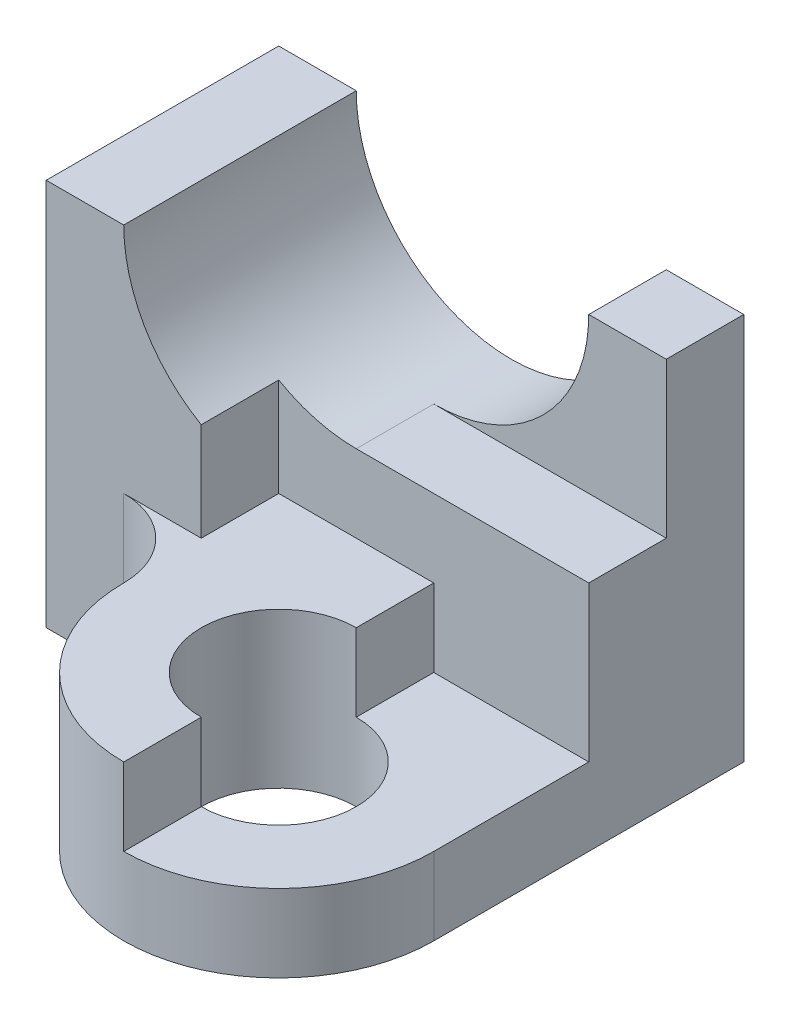
ISO-10303-21;
HEADER;
FILE_DESCRIPTION(('STEP AP214'),'2;1');
FILE_NAME('part.step','',(''),(''),'','','');
FILE_SCHEMA(('AUTOMOTIVE_DESIGN { 1 0 10303 214 1 1 1 1 }'));
ENDSEC;
DATA;
#1=APPLICATION_CONTEXT('core data for automotive mechanical design processes');
#2=APPLICATION_PROTOCOL_DEFINITION('international standard','automotive_design',2000,#1);
#3=PRODUCT_CONTEXT('',#1,'mechanical');
#4=PRODUCT('Part','Part','',(#3));
#5=PRODUCT_RELATED_PRODUCT_CATEGORY('part','',(#4));
#6=PRODUCT_DEFINITION_FORMATION('','',#4);
#7=PRODUCT_DEFINITION_CONTEXT('part definition',#1,'design');
#8=PRODUCT_DEFINITION('design','',#6,#7);
#9=PRODUCT_DEFINITION_SHAPE('','',#8);
#10=(LENGTH_UNIT() NAMED_UNIT(*) SI_UNIT(.MILLI.,.METRE.));
#11=(NAMED_UNIT(*) PLANE_ANGLE_UNIT() SI_UNIT($,.RADIAN.));
#12=(NAMED_UNIT(*) SI_UNIT($,.STERADIAN.) SOLID_ANGLE_UNIT());
#13=UNCERTAINTY_MEASURE_WITH_UNIT(LENGTH_MEASURE(1.E-05),#10,'distance_accuracy_value','');
#14=(GEOMETRIC_REPRESENTATION_CONTEXT(3) GLOBAL_UNCERTAINTY_ASSIGNED_CONTEXT((#13)) GLOBAL_UNIT_ASSIGNED_CONTEXT((#10,
#11,#12)) REPRESENTATION_CONTEXT('',''));
#15=CARTESIAN_POINT('',(0.,0.,0.));
#16=DIRECTION('',(0.,0.,1.));
#17=DIRECTION('',(1.,0.,0.));
#18=AXIS2_PLACEMENT_3D('',#15,#16,#17);
#19=CARTESIAN_POINT('',(0.,0.,3.));
#20=DIRECTION('',(0.,0.,1.));
#21=DIRECTION('',(1.,0.,0.));
#22=AXIS2_PLACEMENT_3D('',#19,#20,#21);
#23=PLANE('',#22);
#24=DIRECTION('',(1.,0.,0.));
#25=VECTOR('',#24,1.);
#26=CARTESIAN_POINT('',(-3.,-5.,3.));
#27=LINE('',#26,#25);
#28=CARTESIAN_POINT('',(-3.,-5.,3.));
#29=VERTEX_POINT('',#28);
#30=CARTESIAN_POINT('',(-2.,-5.,3.));
#31=VERTEX_POINT('',#30);
#32=EDGE_CURVE('E243',#29,#31,#27,.T.);
#33=ORIENTED_EDGE('',*,*,#32,.T.);
#34=DIRECTION('',(0.,-1.,0.));
#35=VECTOR('',#34,1.);
#36=CARTESIAN_POINT('',(-2.,-3.,3.));
#37=LINE('',#36,#35);
#38=CARTESIAN_POINT('',(-2.,-3.,3.));
#39=VERTEX_POINT('',#38);
#40=EDGE_CURVE('E56',#39,#31,#37,.T.);
#41=ORIENTED_EDGE('',*,*,#40,.F.);
#42=DIRECTION('',(1.,0.,0.));
#43=VECTOR('',#42,1.);
#44=CARTESIAN_POINT('',(-2.,-3.,3.));
#45=LINE('',#44,#43);
#46=CARTESIAN_POINT('',(-1.,-3.,3.));
#47=VERTEX_POINT('',#46);
#48=EDGE_CURVE('E195',#39,#47,#45,.T.);
#49=ORIENTED_EDGE('',*,*,#48,.T.);
#50=DIRECTION('',(0.,-1.,0.));
#51=VECTOR('',#50,1.);
#52=CARTESIAN_POINT('',(-1.,-1.73205080756888,3.));
#53=LINE('',#52,#51);
#54=CARTESIAN_POINT('',(-1.,-1.73205080756888,3.));
#55=VERTEX_POINT('',#54);
#56=EDGE_CURVE('E212',#55,#47,#53,.T.);
#57=ORIENTED_EDGE('',*,*,#56,.F.);
#58=CARTESIAN_POINT('',(0.,0.,3.));
#59=DIRECTION('',(0.,0.,-1.));
#60=DIRECTION('',(1.,0.,0.));
#61=AXIS2_PLACEMENT_3D('',#58,#59,#60);
#62=CIRCLE('',#61,2.);
#63=CARTESIAN_POINT('',(-2.,0.,3.));
#64=VERTEX_POINT('',#63);
#65=EDGE_CURVE('E236',#55,#64,#62,.T.);
#66=ORIENTED_EDGE('',*,*,#65,.T.);
#67=DIRECTION('',(-1.,0.,0.));
#68=VECTOR('',#67,1.);
#69=CARTESIAN_POINT('',(-2.,0.,3.));
#70=LINE('',#69,#68);
#71=CARTESIAN_POINT('',(-3.,0.,3.));
#72=VERTEX_POINT('',#71);
#73=EDGE_CURVE('E238',#64,#72,#70,.T.);
#74=ORIENTED_EDGE('',*,*,#73,.T.);
#75=DIRECTION('',(0.,-1.,0.));
#76=VECTOR('',#75,1.);
#77=CARTESIAN_POINT('',(-3.,0.,3.));
#78=LINE('',#77,#76);
#79=EDGE_CURVE('E241',#72,#29,#78,.T.);
#80=ORIENTED_EDGE('',*,*,#79,.T.);
#81=EDGE_LOOP('',(#33,#41,#49,#57,#66,#74,#80));
#82=FACE_BOUND('',#81,.T.);
#83=ADVANCED_FACE('F33',(#82),#23,.T.);
#84=CARTESIAN_POINT('',(-1.,-5.,2.));
#85=DIRECTION('',(0.,0.,-1.));
#86=DIRECTION('',(-1.,0.,0.));
#87=AXIS2_PLACEMENT_3D('',#84,#85,#86);
#88=PLANE('',#87);
#89=DIRECTION('',(1.,0.,0.));
#90=VECTOR('',#89,1.);
#91=CARTESIAN_POINT('',(-1.,-3.,2.));
#92=LINE('',#91,#90);
#93=CARTESIAN_POINT('',(-1.,-3.,2.));
#94=VERTEX_POINT('',#93);
#95=CARTESIAN_POINT('',(1.,-3.,2.));
#96=VERTEX_POINT('',#95);
#97=EDGE_CURVE('E159',#94,#96,#92,.T.);
#98=ORIENTED_EDGE('',*,*,#97,.T.);
#99=DIRECTION('',(0.,1.,0.));
#100=VECTOR('',#99,1.);
#101=CARTESIAN_POINT('',(1.,-4.,2.));
#102=LINE('',#101,#100);
#103=CARTESIAN_POINT('',(1.,-4.,2.));
#104=VERTEX_POINT('',#103);
#105=EDGE_CURVE('E153',#104,#96,#102,.T.);
#106=ORIENTED_EDGE('',*,*,#105,.F.);
#107=DIRECTION('',(-1.,0.,0.));
#108=VECTOR('',#107,1.);
#109=CARTESIAN_POINT('',(1.,-4.,2.));
#110=LINE('',#109,#108);
#111=CARTESIAN_POINT('',(3.,-4.,2.));
#112=VERTEX_POINT('',#111);
#113=EDGE_CURVE('E155',#112,#104,#110,.T.);
#114=ORIENTED_EDGE('',*,*,#113,.F.);
#115=DIRECTION('',(0.,1.,0.));
#116=VECTOR('',#115,1.);
#117=CARTESIAN_POINT('',(3.,-5.,2.));
#118=LINE('',#117,#116);
#119=CARTESIAN_POINT('',(3.,-2.,2.));
#120=VERTEX_POINT('',#119);
#121=EDGE_CURVE('E211',#112,#120,#118,.T.);
#122=ORIENTED_EDGE('',*,*,#121,.T.);
#123=DIRECTION('',(-1.,0.,0.));
#124=VECTOR('',#123,1.);
#125=CARTESIAN_POINT('',(0.,-2.,2.));
#126=LINE('',#125,#124);
#127=CARTESIAN_POINT('',(0.,-2.,2.));
#128=VERTEX_POINT('',#127);
#129=EDGE_CURVE('E274',#120,#128,#126,.T.);
#130=ORIENTED_EDGE('',*,*,#129,.T.);
#131=CARTESIAN_POINT('',(0.,0.,2.));
#132=DIRECTION('',(0.,0.,-1.));
#133=DIRECTION('',(-1.,0.,0.));
#134=AXIS2_PLACEMENT_3D('',#131,#132,#133);
#135=CIRCLE('',#134,2.);
#136=CARTESIAN_POINT('',(-1.,-1.73205080756888,2.));
#137=VERTEX_POINT('',#136);
#138=EDGE_CURVE('E219',#137,#128,#135,.F.);
#139=ORIENTED_EDGE('',*,*,#138,.F.);
#140=DIRECTION('',(0.,1.,0.));
#141=VECTOR('',#140,1.);
#142=CARTESIAN_POINT('',(-1.,-5.,2.));
#143=LINE('',#142,#141);
#144=EDGE_CURVE('E215',#94,#137,#143,.T.);
#145=ORIENTED_EDGE('',*,*,#144,.F.);
#146=EDGE_LOOP('',(#98,#106,#114,#122,#130,#139,#145));
#147=FACE_BOUND('',#146,.T.);
#148=ADVANCED_FACE('F154',(#147),#88,.F.);
#149=CARTESIAN_POINT('',(-1.,0.,0.));
#150=DIRECTION('',(1.,0.,0.));
#151=DIRECTION('',(0.,0.,-1.));
#152=AXIS2_PLACEMENT_3D('',#149,#150,#151);
#153=PLANE('',#152);
#154=ORIENTED_EDGE('',*,*,#56,.T.);
#155=DIRECTION('',(0.,0.,-1.));
#156=VECTOR('',#155,1.);
#157=CARTESIAN_POINT('',(-1.,-3.,3.));
#158=LINE('',#157,#156);
#159=EDGE_CURVE('E197',#47,#94,#158,.T.);
#160=ORIENTED_EDGE('',*,*,#159,.T.);
#161=ORIENTED_EDGE('',*,*,#144,.T.);
#162=DIRECTION('',(0.,0.,1.));
#163=VECTOR('',#162,1.);
#164=CARTESIAN_POINT('',(-1.,-1.73205080756888,2.));
#165=LINE('',#164,#163);
#166=EDGE_CURVE('E217',#137,#55,#165,.T.);
#167=ORIENTED_EDGE('',*,*,#166,.T.);
#168=EDGE_LOOP('',(#154,#160,#161,#167));
#169=FACE_BOUND('',#168,.T.);
#170=ADVANCED_FACE('F320',(#169),#153,.T.);
#171=CARTESIAN_POINT('',(0.,0.,3.));
#172=DIRECTION('',(0.,0.,-1.));
#173=DIRECTION('',(-1.,0.,0.));
#174=AXIS2_PLACEMENT_3D('',#171,#172,#173);
#175=CYLINDRICAL_SURFACE('',#174,2.);
#176=DIRECTION('',(0.,0.,1.));
#177=VECTOR('',#176,1.);
#178=CARTESIAN_POINT('',(0.,-2.,1.));
#179=LINE('',#178,#177);
#180=CARTESIAN_POINT('',(0.,-2.,1.));
#181=VERTEX_POINT('',#180);
#182=EDGE_CURVE('E205',#181,#128,#179,.T.);
#183=ORIENTED_EDGE('',*,*,#182,.F.);
#184=CARTESIAN_POINT('',(0.,0.,1.));
#185=DIRECTION('',(0.,0.,-1.));
#186=DIRECTION('',(-1.,0.,0.));
#187=AXIS2_PLACEMENT_3D('',#184,#185,#186);
#188=CIRCLE('',#187,2.);
#189=CARTESIAN_POINT('',(2.,0.,1.));
#190=VERTEX_POINT('',#189);
#191=EDGE_CURVE('E232',#181,#190,#188,.F.);
#192=ORIENTED_EDGE('',*,*,#191,.T.);
#193=DIRECTION('',(0.,0.,-1.));
#194=VECTOR('',#193,1.);
#195=CARTESIAN_POINT('',(2.,0.,3.));
#196=LINE('',#195,#194);
#197=CARTESIAN_POINT('',(2.,0.,0.));
#198=VERTEX_POINT('',#197);
#199=EDGE_CURVE('E245',#190,#198,#196,.T.);
#200=ORIENTED_EDGE('',*,*,#199,.T.);
#201=CARTESIAN_POINT('',(0.,0.,0.));
#202=DIRECTION('',(0.,0.,-1.));
#203=DIRECTION('',(1.,0.,0.));
#204=AXIS2_PLACEMENT_3D('',#201,#202,#203);
#205=CIRCLE('',#204,2.);
#206=CARTESIAN_POINT('',(-2.,0.,0.));
#207=VERTEX_POINT('',#206);
#208=EDGE_CURVE('E235',#198,#207,#205,.T.);
#209=ORIENTED_EDGE('',*,*,#208,.T.);
#210=DIRECTION('',(0.,0.,-1.));
#211=VECTOR('',#210,1.);
#212=CARTESIAN_POINT('',(-2.,0.,3.));
#213=LINE('',#212,#211);
#214=EDGE_CURVE('E271',#64,#207,#213,.T.);
#215=ORIENTED_EDGE('',*,*,#214,.F.);
#216=ORIENTED_EDGE('',*,*,#65,.F.);
#217=ORIENTED_EDGE('',*,*,#166,.F.);
#218=ORIENTED_EDGE('',*,*,#138,.T.);
#219=EDGE_LOOP('',(#183,#192,#200,#209,#215,#216,#217,#218));
#220=FACE_BOUND('',#219,.T.);
#221=ADVANCED_FACE('F35',(#220),#175,.F.);
#222=CARTESIAN_POINT('',(-2.,0.,3.));
#223=DIRECTION('',(0.,-1.,0.));
#224=DIRECTION('',(1.,0.,0.));
#225=AXIS2_PLACEMENT_3D('',#222,#223,#224);
#226=PLANE('',#225);
#227=DIRECTION('',(-1.,0.,0.));
#228=VECTOR('',#227,1.);
#229=CARTESIAN_POINT('',(-2.,0.,0.));
#230=LINE('',#229,#228);
#231=CARTESIAN_POINT('',(-3.,0.,0.));
#232=VERTEX_POINT('',#231);
#233=EDGE_CURVE('E248',#207,#232,#230,.T.);
#234=ORIENTED_EDGE('',*,*,#233,.T.);
#235=DIRECTION('',(0.,0.,-1.));
#236=VECTOR('',#235,1.);
#237=CARTESIAN_POINT('',(-3.,0.,3.));
#238=LINE('',#237,#236);
#239=EDGE_CURVE('E268',#72,#232,#238,.T.);
#240=ORIENTED_EDGE('',*,*,#239,.F.);
#241=ORIENTED_EDGE('',*,*,#73,.F.);
#242=ORIENTED_EDGE('',*,*,#214,.T.);
#243=EDGE_LOOP('',(#234,#240,#241,#242));
#244=FACE_BOUND('',#243,.T.);
#245=ADVANCED_FACE('F326',(#244),#226,.F.);
#246=CARTESIAN_POINT('',(-3.,0.,3.));
#247=DIRECTION('',(1.,0.,0.));
#248=DIRECTION('',(0.,1.,0.));
#249=AXIS2_PLACEMENT_3D('',#246,#247,#248);
#250=PLANE('',#249);
#251=DIRECTION('',(0.,-1.,0.));
#252=VECTOR('',#251,1.);
#253=CARTESIAN_POINT('',(-3.,0.,0.));
#254=LINE('',#253,#252);
#255=CARTESIAN_POINT('',(-3.,-5.,0.));
#256=VERTEX_POINT('',#255);
#257=EDGE_CURVE('E250',#232,#256,#254,.T.);
#258=ORIENTED_EDGE('',*,*,#257,.T.);
#259=DIRECTION('',(0.,0.,-1.));
#260=VECTOR('',#259,1.);
#261=CARTESIAN_POINT('',(-3.,-5.,3.));
#262=LINE('',#261,#260);
#263=EDGE_CURVE('E265',#29,#256,#262,.T.);
#264=ORIENTED_EDGE('',*,*,#263,.F.);
#265=ORIENTED_EDGE('',*,*,#79,.F.);
#266=ORIENTED_EDGE('',*,*,#239,.T.);
#267=EDGE_LOOP('',(#258,#264,#265,#266));
#268=FACE_BOUND('',#267,.T.);
#269=ADVANCED_FACE('F331',(#268),#250,.F.);
#270=CARTESIAN_POINT('',(-3.,-5.,3.));
#271=DIRECTION('',(0.,1.,0.));
#272=DIRECTION('',(0.,0.,1.));
#273=AXIS2_PLACEMENT_3D('',#270,#271,#272);
#274=PLANE('',#273);
#275=DIRECTION('',(0.,0.,-1.));
#276=VECTOR('',#275,1.);
#277=CARTESIAN_POINT('',(3.,-5.,3.));
#278=LINE('',#277,#276);
#279=CARTESIAN_POINT('',(3.,-5.,4.));
#280=VERTEX_POINT('',#279);
#281=CARTESIAN_POINT('',(3.,-5.,0.));
#282=VERTEX_POINT('',#281);
#283=EDGE_CURVE('E263',#280,#282,#278,.T.);
#284=ORIENTED_EDGE('',*,*,#283,.F.);
#285=CARTESIAN_POINT('',(1.,-5.,4.));
#286=DIRECTION('',(0.,-1.,0.));
#287=DIRECTION('',(0.,0.,-1.));
#288=AXIS2_PLACEMENT_3D('',#285,#286,#287);
#289=CIRCLE('',#288,2.);
#290=CARTESIAN_POINT('',(-1.,-5.,4.));
#291=VERTEX_POINT('',#290);
#292=EDGE_CURVE('E185',#280,#291,#289,.T.);
#293=ORIENTED_EDGE('',*,*,#292,.T.);
#294=CARTESIAN_POINT('',(-2.,-5.,4.));
#295=DIRECTION('',(0.,1.,0.));
#296=DIRECTION('',(0.,0.,1.));
#297=AXIS2_PLACEMENT_3D('',#294,#295,#296);
#298=CIRCLE('',#297,1.);
#299=EDGE_CURVE('E190',#291,#31,#298,.T.);
#300=ORIENTED_EDGE('',*,*,#299,.T.);
#301=ORIENTED_EDGE('',*,*,#32,.F.);
#302=ORIENTED_EDGE('',*,*,#263,.T.);
#303=DIRECTION('',(1.,0.,0.));
#304=VECTOR('',#303,1.);
#305=CARTESIAN_POINT('',(-3.,-5.,0.));
#306=LINE('',#305,#304);
#307=EDGE_CURVE('E252',#256,#282,#306,.T.);
#308=ORIENTED_EDGE('',*,*,#307,.T.);
#309=EDGE_LOOP('',(#284,#293,#300,#301,#302,#308));
#310=FACE_BOUND('',#309,.T.);
#311=CARTESIAN_POINT('',(1.,-5.,4.));
#312=DIRECTION('',(0.,-1.,0.));
#313=DIRECTION('',(0.,0.,-1.));
#314=AXIS2_PLACEMENT_3D('',#311,#312,#313);
#315=CIRCLE('',#314,1.);
#316=CARTESIAN_POINT('',(1.,-5.,3.));
#317=VERTEX_POINT('',#316);
#318=EDGE_CURVE('E180',#317,#317,#315,.T.);
#319=ORIENTED_EDGE('',*,*,#318,.F.);
#320=EDGE_LOOP('',(#319));
#321=FACE_BOUND('',#320,.T.);
#322=ADVANCED_FACE('F302',(#310,#321),#274,.F.);
#323=CARTESIAN_POINT('',(3.,-5.,3.));
#324=DIRECTION('',(-1.,0.,0.));
#325=DIRECTION('',(0.,0.,1.));
#326=AXIS2_PLACEMENT_3D('',#323,#324,#325);
#327=PLANE('',#326);
#328=ORIENTED_EDGE('',*,*,#121,.F.);
#329=DIRECTION('',(0.,0.,-1.));
#330=VECTOR('',#329,1.);
#331=CARTESIAN_POINT('',(3.,-4.,2.));
#332=LINE('',#331,#330);
#333=CARTESIAN_POINT('',(3.,-4.,4.));
#334=VERTEX_POINT('',#333);
#335=EDGE_CURVE('E163',#334,#112,#332,.T.);
#336=ORIENTED_EDGE('',*,*,#335,.F.);
#337=DIRECTION('',(0.,-1.,0.));
#338=VECTOR('',#337,1.);
#339=CARTESIAN_POINT('',(3.,-3.,4.));
#340=LINE('',#339,#338);
#341=EDGE_CURVE('E199',#334,#280,#340,.T.);
#342=ORIENTED_EDGE('',*,*,#341,.T.);
#343=ORIENTED_EDGE('',*,*,#283,.T.);
#344=DIRECTION('',(0.,1.,0.));
#345=VECTOR('',#344,1.);
#346=CARTESIAN_POINT('',(3.,-5.,0.));
#347=LINE('',#346,#345);
#348=CARTESIAN_POINT('',(3.,0.,0.));
#349=VERTEX_POINT('',#348);
#350=EDGE_CURVE('E255',#282,#349,#347,.T.);
#351=ORIENTED_EDGE('',*,*,#350,.T.);
#352=DIRECTION('',(0.,0.,-1.));
#353=VECTOR('',#352,1.);
#354=CARTESIAN_POINT('',(3.,0.,3.));
#355=LINE('',#354,#353);
#356=CARTESIAN_POINT('',(3.,0.,1.));
#357=VERTEX_POINT('',#356);
#358=EDGE_CURVE('E261',#357,#349,#355,.T.);
#359=ORIENTED_EDGE('',*,*,#358,.F.);
#360=DIRECTION('',(0.,1.,0.));
#361=VECTOR('',#360,1.);
#362=CARTESIAN_POINT('',(3.,-2.,1.));
#363=LINE('',#362,#361);
#364=CARTESIAN_POINT('',(3.,-2.,1.));
#365=VERTEX_POINT('',#364);
#366=EDGE_CURVE('E229',#365,#357,#363,.T.);
#367=ORIENTED_EDGE('',*,*,#366,.F.);
#368=DIRECTION('',(0.,0.,-1.));
#369=VECTOR('',#368,1.);
#370=CARTESIAN_POINT('',(3.,-2.,3.));
#371=LINE('',#370,#369);
#372=EDGE_CURVE('E224',#120,#365,#371,.T.);
#373=ORIENTED_EDGE('',*,*,#372,.F.);
#374=EDGE_LOOP('',(#328,#336,#342,#343,#351,#359,#367,#373));
#375=FACE_BOUND('',#374,.T.);
#376=ADVANCED_FACE('F306',(#375),#327,.F.);
#377=CARTESIAN_POINT('',(3.,0.,3.));
#378=DIRECTION('',(0.,-1.,0.));
#379=DIRECTION('',(1.,0.,0.));
#380=AXIS2_PLACEMENT_3D('',#377,#378,#379);
#381=PLANE('',#380);
#382=ORIENTED_EDGE('',*,*,#199,.F.);
#383=DIRECTION('',(-1.,0.,0.));
#384=VECTOR('',#383,1.);
#385=CARTESIAN_POINT('',(3.,0.,1.));
#386=LINE('',#385,#384);
#387=EDGE_CURVE('E223',#357,#190,#386,.T.);
#388=ORIENTED_EDGE('',*,*,#387,.F.);
#389=ORIENTED_EDGE('',*,*,#358,.T.);
#390=DIRECTION('',(-1.,0.,0.));
#391=VECTOR('',#390,1.);
#392=CARTESIAN_POINT('',(3.,0.,0.));
#393=LINE('',#392,#391);
#394=EDGE_CURVE('E239',#349,#198,#393,.T.);
#395=ORIENTED_EDGE('',*,*,#394,.T.);
#396=EDGE_LOOP('',(#382,#388,#389,#395));
#397=FACE_BOUND('',#396,.T.);
#398=ADVANCED_FACE('F342',(#397),#381,.F.);
#399=CARTESIAN_POINT('',(0.,0.,0.));
#400=DIRECTION('',(0.,0.,1.));
#401=DIRECTION('',(1.,0.,0.));
#402=AXIS2_PLACEMENT_3D('',#399,#400,#401);
#403=PLANE('',#402);
#404=ORIENTED_EDGE('',*,*,#208,.F.);
#405=ORIENTED_EDGE('',*,*,#394,.F.);
#406=ORIENTED_EDGE('',*,*,#350,.F.);
#407=ORIENTED_EDGE('',*,*,#307,.F.);
#408=ORIENTED_EDGE('',*,*,#257,.F.);
#409=ORIENTED_EDGE('',*,*,#233,.F.);
#410=EDGE_LOOP('',(#404,#405,#406,#407,#408,#409));
#411=FACE_BOUND('',#410,.T.);
#412=ADVANCED_FACE('F336',(#411),#403,.F.);
#413=CARTESIAN_POINT('',(3.,-2.,1.));
#414=DIRECTION('',(0.,0.,-1.));
#415=DIRECTION('',(-1.,0.,0.));
#416=AXIS2_PLACEMENT_3D('',#413,#414,#415);
#417=PLANE('',#416);
#418=ORIENTED_EDGE('',*,*,#191,.F.);
#419=DIRECTION('',(-1.,0.,0.));
#420=VECTOR('',#419,1.);
#421=CARTESIAN_POINT('',(3.,-2.,1.));
#422=LINE('',#421,#420);
#423=EDGE_CURVE('E226',#365,#181,#422,.T.);
#424=ORIENTED_EDGE('',*,*,#423,.F.);
#425=ORIENTED_EDGE('',*,*,#366,.T.);
#426=ORIENTED_EDGE('',*,*,#387,.T.);
#427=EDGE_LOOP('',(#418,#424,#425,#426));
#428=FACE_BOUND('',#427,.T.);
#429=ADVANCED_FACE('F344',(#428),#417,.F.);
#430=CARTESIAN_POINT('',(0.,-2.,0.));
#431=DIRECTION('',(0.,1.,0.));
#432=DIRECTION('',(-1.,0.,0.));
#433=AXIS2_PLACEMENT_3D('',#430,#431,#432);
#434=PLANE('',#433);
#435=ORIENTED_EDGE('',*,*,#129,.F.);
#436=ORIENTED_EDGE('',*,*,#372,.T.);
#437=ORIENTED_EDGE('',*,*,#423,.T.);
#438=ORIENTED_EDGE('',*,*,#182,.T.);
#439=EDGE_LOOP('',(#435,#436,#437,#438));
#440=FACE_BOUND('',#439,.T.);
#441=ADVANCED_FACE('F312',(#440),#434,.T.);
#442=CARTESIAN_POINT('',(-2.,-3.,4.));
#443=DIRECTION('',(0.,-1.,0.));
#444=DIRECTION('',(0.,0.,-1.));
#445=AXIS2_PLACEMENT_3D('',#442,#443,#444);
#446=CYLINDRICAL_SURFACE('',#445,1.);
#447=ORIENTED_EDGE('',*,*,#299,.F.);
#448=DIRECTION('',(0.,-1.,0.));
#449=VECTOR('',#448,1.);
#450=CARTESIAN_POINT('',(-1.,-3.,4.));
#451=LINE('',#450,#449);
#452=CARTESIAN_POINT('',(-1.,-3.,4.));
#453=VERTEX_POINT('',#452);
#454=EDGE_CURVE('E206',#453,#291,#451,.T.);
#455=ORIENTED_EDGE('',*,*,#454,.F.);
#456=CARTESIAN_POINT('',(-2.,-3.,4.));
#457=DIRECTION('',(0.,1.,0.));
#458=DIRECTION('',(0.,0.,1.));
#459=AXIS2_PLACEMENT_3D('',#456,#457,#458);
#460=CIRCLE('',#459,1.);
#461=EDGE_CURVE('E192',#453,#39,#460,.T.);
#462=ORIENTED_EDGE('',*,*,#461,.T.);
#463=ORIENTED_EDGE('',*,*,#40,.T.);
#464=EDGE_LOOP('',(#447,#455,#462,#463));
#465=FACE_BOUND('',#464,.T.);
#466=ADVANCED_FACE('F298',(#465),#446,.F.);
#467=CARTESIAN_POINT('',(1.,-3.,4.));
#468=DIRECTION('',(0.,-1.,0.));
#469=DIRECTION('',(0.,0.,-1.));
#470=AXIS2_PLACEMENT_3D('',#467,#468,#469);
#471=CYLINDRICAL_SURFACE('',#470,2.);
#472=DIRECTION('',(0.,1.,0.));
#473=VECTOR('',#472,1.);
#474=CARTESIAN_POINT('',(1.,-4.,6.));
#475=LINE('',#474,#473);
#476=CARTESIAN_POINT('',(1.,-4.,6.));
#477=VERTEX_POINT('',#476);
#478=CARTESIAN_POINT('',(1.,-3.,6.));
#479=VERTEX_POINT('',#478);
#480=EDGE_CURVE('E162',#477,#479,#475,.T.);
#481=ORIENTED_EDGE('',*,*,#480,.T.);
#482=CARTESIAN_POINT('',(1.,-3.,4.));
#483=DIRECTION('',(0.,-1.,0.));
#484=DIRECTION('',(0.,0.,-1.));
#485=AXIS2_PLACEMENT_3D('',#482,#483,#484);
#486=CIRCLE('',#485,2.);
#487=EDGE_CURVE('E189',#479,#453,#486,.T.);
#488=ORIENTED_EDGE('',*,*,#487,.T.);
#489=ORIENTED_EDGE('',*,*,#454,.T.);
#490=ORIENTED_EDGE('',*,*,#292,.F.);
#491=ORIENTED_EDGE('',*,*,#341,.F.);
#492=CARTESIAN_POINT('',(1.00000000000001,-4.,4.00000000000001));
#493=DIRECTION('',(0.,1.,0.));
#494=DIRECTION('',(0.,0.,1.));
#495=AXIS2_PLACEMENT_3D('',#492,#493,#494);
#496=CIRCLE('',#495,1.99999999999999);
#497=EDGE_CURVE('E167',#477,#334,#496,.T.);
#498=ORIENTED_EDGE('',*,*,#497,.F.);
#499=EDGE_LOOP('',(#481,#488,#489,#490,#491,#498));
#500=FACE_BOUND('',#499,.T.);
#501=ADVANCED_FACE('F293',(#500),#471,.T.);
#502=CARTESIAN_POINT('',(1.,-3.,4.));
#503=DIRECTION('',(0.,-1.,0.));
#504=DIRECTION('',(0.,0.,-1.));
#505=AXIS2_PLACEMENT_3D('',#502,#503,#504);
#506=PLANE('',#505);
#507=ORIENTED_EDGE('',*,*,#487,.F.);
#508=DIRECTION('',(0.,0.,1.));
#509=VECTOR('',#508,1.);
#510=CARTESIAN_POINT('',(1.,-3.,2.));
#511=LINE('',#510,#509);
#512=CARTESIAN_POINT('',(1.,-3.,5.));
#513=VERTEX_POINT('',#512);
#514=EDGE_CURVE('E174',#513,#479,#511,.T.);
#515=ORIENTED_EDGE('',*,*,#514,.F.);
#516=CARTESIAN_POINT('',(1.,-3.,4.));
#517=DIRECTION('',(0.,-1.,0.));
#518=DIRECTION('',(0.,0.,-1.));
#519=AXIS2_PLACEMENT_3D('',#516,#517,#518);
#520=CIRCLE('',#519,1.);
#521=CARTESIAN_POINT('',(1.,-3.,3.));
#522=VERTEX_POINT('',#521);
#523=EDGE_CURVE('E182',#513,#522,#520,.T.);
#524=ORIENTED_EDGE('',*,*,#523,.T.);
#525=EDGE_CURVE('E172',#96,#522,#511,.T.);
#526=ORIENTED_EDGE('',*,*,#525,.F.);
#527=ORIENTED_EDGE('',*,*,#97,.F.);
#528=ORIENTED_EDGE('',*,*,#159,.F.);
#529=ORIENTED_EDGE('',*,*,#48,.F.);
#530=ORIENTED_EDGE('',*,*,#461,.F.);
#531=EDGE_LOOP('',(#507,#515,#524,#526,#527,#528,#529,#530));
#532=FACE_BOUND('',#531,.T.);
#533=ADVANCED_FACE('F289',(#532),#506,.F.);
#534=CARTESIAN_POINT('',(1.,-3.,4.));
#535=DIRECTION('',(0.,-1.,0.));
#536=DIRECTION('',(0.,0.,-1.));
#537=AXIS2_PLACEMENT_3D('',#534,#535,#536);
#538=CYLINDRICAL_SURFACE('',#537,1.);
#539=CARTESIAN_POINT('',(1.,-4.,4.));
#540=DIRECTION('',(0.,1.,0.));
#541=DIRECTION('',(0.,0.,1.));
#542=AXIS2_PLACEMENT_3D('',#539,#540,#541);
#543=CIRCLE('',#542,1.);
#544=CARTESIAN_POINT('',(1.,-4.,3.));
#545=VERTEX_POINT('',#544);
#546=CARTESIAN_POINT('',(1.,-4.,5.));
#547=VERTEX_POINT('',#546);
#548=EDGE_CURVE('E276',#545,#547,#543,.F.);
#549=ORIENTED_EDGE('',*,*,#548,.F.);
#550=DIRECTION('',(0.,-1.,0.));
#551=VECTOR('',#550,1.);
#552=CARTESIAN_POINT('',(1.,-3.,3.));
#553=LINE('',#552,#551);
#554=EDGE_CURVE('E11',#545,#522,#553,.F.);
#555=ORIENTED_EDGE('',*,*,#554,.T.);
#556=ORIENTED_EDGE('',*,*,#523,.F.);
#557=DIRECTION('',(0.,-1.,0.));
#558=VECTOR('',#557,1.);
#559=CARTESIAN_POINT('',(1.,-3.,5.));
#560=LINE('',#559,#558);
#561=EDGE_CURVE('E41',#513,#547,#560,.T.);
#562=ORIENTED_EDGE('',*,*,#561,.T.);
#563=EDGE_LOOP('',(#549,#555,#556,#562));
#564=FACE_BOUND('',#563,.T.);
#565=ORIENTED_EDGE('',*,*,#318,.T.);
#566=EDGE_LOOP('',(#565));
#567=FACE_BOUND('',#566,.T.);
#568=ADVANCED_FACE('F280',(#564,#567),#538,.F.);
#569=CARTESIAN_POINT('',(1.,-4.,2.));
#570=DIRECTION('',(-1.,0.,0.));
#571=DIRECTION('',(0.,0.,1.));
#572=AXIS2_PLACEMENT_3D('',#569,#570,#571);
#573=PLANE('',#572);
#574=DIRECTION('',(0.,0.,1.));
#575=VECTOR('',#574,1.);
#576=CARTESIAN_POINT('',(1.,-4.,2.));
#577=LINE('',#576,#575);
#578=EDGE_CURVE('E48',#104,#545,#577,.T.);
#579=ORIENTED_EDGE('',*,*,#578,.F.);
#580=ORIENTED_EDGE('',*,*,#105,.T.);
#581=ORIENTED_EDGE('',*,*,#525,.T.);
#582=ORIENTED_EDGE('',*,*,#554,.F.);
#583=EDGE_LOOP('',(#579,#580,#581,#582));
#584=FACE_BOUND('',#583,.T.);
#585=ADVANCED_FACE('F165',(#584),#573,.F.);
#586=ORIENTED_EDGE('',*,*,#514,.T.);
#587=ORIENTED_EDGE('',*,*,#480,.F.);
#588=EDGE_CURVE('E168',#547,#477,#577,.T.);
#589=ORIENTED_EDGE('',*,*,#588,.F.);
#590=ORIENTED_EDGE('',*,*,#561,.F.);
#591=EDGE_LOOP('',(#586,#587,#589,#590));
#592=FACE_BOUND('',#591,.T.);
#593=ADVANCED_FACE('F285',(#592),#573,.F.);
#594=CARTESIAN_POINT('',(1.00000000000001,-4.,4.00000000000001));
#595=DIRECTION('',(0.,1.,0.));
#596=DIRECTION('',(0.,0.,1.));
#597=AXIS2_PLACEMENT_3D('',#594,#595,#596);
#598=PLANE('',#597);
#599=ORIENTED_EDGE('',*,*,#548,.T.);
#600=ORIENTED_EDGE('',*,*,#588,.T.);
#601=ORIENTED_EDGE('',*,*,#497,.T.);
#602=ORIENTED_EDGE('',*,*,#335,.T.);
#603=ORIENTED_EDGE('',*,*,#113,.T.);
#604=ORIENTED_EDGE('',*,*,#578,.T.);
#605=EDGE_LOOP('',(#599,#600,#601,#602,#603,#604));
#606=FACE_BOUND('',#605,.T.);
#607=ADVANCED_FACE('F170',(#606),#598,.T.);
#608=CLOSED_SHELL('',(#83,#148,#170,#221,#245,#269,#322,#376,#398,#412,#429,#441,#466,#501,#533,
#568,#585,#593,#607));
#609=MANIFOLD_SOLID_BREP('B2',#608);
#610=ADVANCED_BREP_SHAPE_REPRESENTATION('',(#18,#609),#14);
#611=SHAPE_DEFINITION_REPRESENTATION(#9,#610);
ENDSEC;
END-ISO-10303-21;
